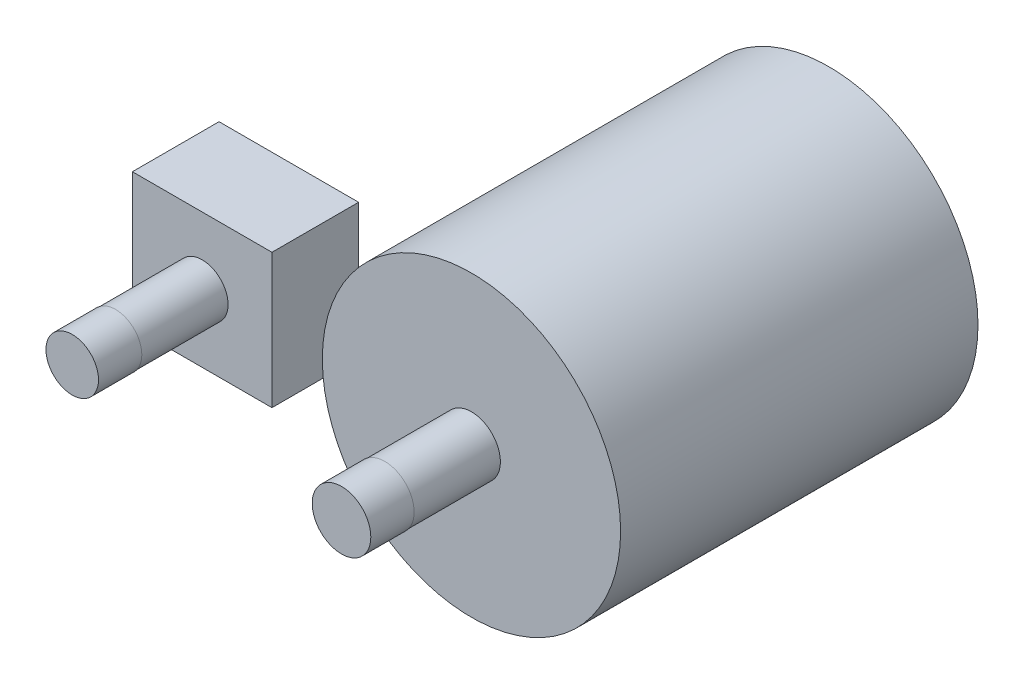
ISO-10303-21;
HEADER;
FILE_DESCRIPTION(('STEP AP214'),'2;1');
FILE_NAME('part.step','',(''),(''),'','','');
FILE_SCHEMA(('AUTOMOTIVE_DESIGN { 1 0 10303 214 1 1 1 1 }'));
ENDSEC;
DATA;
#1=APPLICATION_CONTEXT('core data for automotive mechanical design processes');
#2=APPLICATION_PROTOCOL_DEFINITION('international standard','automotive_design',2000,#1);
#3=PRODUCT_CONTEXT('',#1,'mechanical');
#4=PRODUCT('Part','Part','',(#3));
#5=PRODUCT_RELATED_PRODUCT_CATEGORY('part','',(#4));
#6=PRODUCT_DEFINITION_FORMATION('','',#4);
#7=PRODUCT_DEFINITION_CONTEXT('part definition',#1,'design');
#8=PRODUCT_DEFINITION('design','',#6,#7);
#9=PRODUCT_DEFINITION_SHAPE('','',#8);
#10=(LENGTH_UNIT() NAMED_UNIT(*) SI_UNIT(.MILLI.,.METRE.));
#11=(NAMED_UNIT(*) PLANE_ANGLE_UNIT() SI_UNIT($,.RADIAN.));
#12=(NAMED_UNIT(*) SI_UNIT($,.STERADIAN.) SOLID_ANGLE_UNIT());
#13=UNCERTAINTY_MEASURE_WITH_UNIT(LENGTH_MEASURE(1.E-05),#10,'distance_accuracy_value','');
#14=(GEOMETRIC_REPRESENTATION_CONTEXT(3) GLOBAL_UNCERTAINTY_ASSIGNED_CONTEXT((#13)) GLOBAL_UNIT_ASSIGNED_CONTEXT((#10,
#11,#12)) REPRESENTATION_CONTEXT('',''));
#15=CARTESIAN_POINT('',(0.,0.,0.));
#16=DIRECTION('',(0.,0.,1.));
#17=DIRECTION('',(1.,0.,0.));
#18=AXIS2_PLACEMENT_3D('',#15,#16,#17);
#19=CARTESIAN_POINT('',(-24.8647244854965,0.,41.));
#20=DIRECTION('',(0.,0.,-1.));
#21=DIRECTION('',(-1.,0.,0.));
#22=AXIS2_PLACEMENT_3D('',#19,#20,#21);
#23=CYLINDRICAL_SURFACE('',#22,2.39175593570654);
#24=CARTESIAN_POINT('',(-24.8647244854965,0.,41.));
#25=DIRECTION('',(0.,0.,1.));
#26=DIRECTION('',(1.,0.,0.));
#27=AXIS2_PLACEMENT_3D('',#24,#25,#26);
#28=CIRCLE('',#27,2.39175593570654);
#29=CARTESIAN_POINT('',(-22.4729685497899,0.,41.));
#30=VERTEX_POINT('',#29);
#31=EDGE_CURVE('E12',#30,#30,#28,.T.);
#32=ORIENTED_EDGE('',*,*,#31,.F.);
#33=EDGE_LOOP('',(#32));
#34=FACE_BOUND('',#33,.T.);
#35=CARTESIAN_POINT('',(-24.8647244854965,0.,33.));
#36=DIRECTION('',(0.,0.,1.));
#37=DIRECTION('',(1.,0.,0.));
#38=AXIS2_PLACEMENT_3D('',#35,#36,#37);
#39=CIRCLE('',#38,2.39175593570654);
#40=CARTESIAN_POINT('',(-22.4729685497899,0.,33.));
#41=VERTEX_POINT('',#40);
#42=EDGE_CURVE('E46',#41,#41,#39,.T.);
#43=ORIENTED_EDGE('',*,*,#42,.T.);
#44=EDGE_LOOP('',(#43));
#45=FACE_BOUND('',#44,.T.);
#46=ADVANCED_FACE('F43',(#34,#45),#23,.T.);
#47=CARTESIAN_POINT('',(-31.3070832551148,-6.21381259878717,25.));
#48=DIRECTION('',(1.,0.,0.));
#49=DIRECTION('',(0.,0.,-1.));
#50=AXIS2_PLACEMENT_3D('',#47,#48,#49);
#51=PLANE('',#50);
#52=DIRECTION('',(0.,1.,0.));
#53=VECTOR('',#52,1.);
#54=CARTESIAN_POINT('',(-31.3070832551148,-6.21381259878717,33.));
#55=LINE('',#54,#53);
#56=CARTESIAN_POINT('',(-31.3070832551148,-6.21381259878717,33.));
#57=VERTEX_POINT('',#56);
#58=CARTESIAN_POINT('',(-31.3070832551148,6.21381259878717,33.));
#59=VERTEX_POINT('',#58);
#60=EDGE_CURVE('E110',#57,#59,#55,.T.);
#61=ORIENTED_EDGE('',*,*,#60,.T.);
#62=DIRECTION('',(0.,0.,1.));
#63=VECTOR('',#62,1.);
#64=CARTESIAN_POINT('',(-31.3070832551148,6.21381259878717,25.));
#65=LINE('',#64,#63);
#66=CARTESIAN_POINT('',(-31.3070832551148,6.21381259878717,25.));
#67=VERTEX_POINT('',#66);
#68=EDGE_CURVE('E101',#67,#59,#65,.T.);
#69=ORIENTED_EDGE('',*,*,#68,.F.);
#70=DIRECTION('',(0.,1.,0.));
#71=VECTOR('',#70,1.);
#72=CARTESIAN_POINT('',(-31.3070832551148,-6.21381259878717,25.));
#73=LINE('',#72,#71);
#74=CARTESIAN_POINT('',(-31.3070832551148,-6.21381259878717,25.));
#75=VERTEX_POINT('',#74);
#76=EDGE_CURVE('E95',#75,#67,#73,.T.);
#77=ORIENTED_EDGE('',*,*,#76,.F.);
#78=DIRECTION('',(0.,0.,1.));
#79=VECTOR('',#78,1.);
#80=CARTESIAN_POINT('',(-31.3070832551148,-6.21381259878717,25.));
#81=LINE('',#80,#79);
#82=EDGE_CURVE('E106',#75,#57,#81,.T.);
#83=ORIENTED_EDGE('',*,*,#82,.T.);
#84=EDGE_LOOP('',(#61,#69,#77,#83));
#85=FACE_BOUND('',#84,.T.);
#86=ADVANCED_FACE('F130',(#85),#51,.F.);
#87=CARTESIAN_POINT('',(-18.4223657158782,6.21381259878717,25.));
#88=DIRECTION('',(0.,-1.,0.));
#89=DIRECTION('',(0.,0.,-1.));
#90=AXIS2_PLACEMENT_3D('',#87,#88,#89);
#91=PLANE('',#90);
#92=DIRECTION('',(1.,0.,0.));
#93=VECTOR('',#92,1.);
#94=CARTESIAN_POINT('',(-18.4223657158782,6.21381259878717,33.));
#95=LINE('',#94,#93);
#96=CARTESIAN_POINT('',(-18.4223657158782,6.21381259878717,33.));
#97=VERTEX_POINT('',#96);
#98=EDGE_CURVE('E100',#59,#97,#95,.T.);
#99=ORIENTED_EDGE('',*,*,#98,.T.);
#100=DIRECTION('',(0.,0.,1.));
#101=VECTOR('',#100,1.);
#102=CARTESIAN_POINT('',(-18.4223657158782,6.21381259878717,25.));
#103=LINE('',#102,#101);
#104=CARTESIAN_POINT('',(-18.4223657158782,6.21381259878717,25.));
#105=VERTEX_POINT('',#104);
#106=EDGE_CURVE('E98',#105,#97,#103,.T.);
#107=ORIENTED_EDGE('',*,*,#106,.F.);
#108=DIRECTION('',(1.,0.,0.));
#109=VECTOR('',#108,1.);
#110=CARTESIAN_POINT('',(-18.4223657158782,6.21381259878717,25.));
#111=LINE('',#110,#109);
#112=EDGE_CURVE('E90',#67,#105,#111,.T.);
#113=ORIENTED_EDGE('',*,*,#112,.F.);
#114=ORIENTED_EDGE('',*,*,#68,.T.);
#115=EDGE_LOOP('',(#99,#107,#113,#114));
#116=FACE_BOUND('',#115,.T.);
#117=ADVANCED_FACE('F99',(#116),#91,.F.);
#118=CARTESIAN_POINT('',(-18.4223657158782,-6.21381259878717,25.));
#119=DIRECTION('',(-1.,0.,0.));
#120=DIRECTION('',(0.,0.,1.));
#121=AXIS2_PLACEMENT_3D('',#118,#119,#120);
#122=PLANE('',#121);
#123=DIRECTION('',(0.,-1.,0.));
#124=VECTOR('',#123,1.);
#125=CARTESIAN_POINT('',(-18.4223657158782,-6.21381259878717,33.));
#126=LINE('',#125,#124);
#127=CARTESIAN_POINT('',(-18.4223657158782,-6.21381259878717,33.));
#128=VERTEX_POINT('',#127);
#129=EDGE_CURVE('E76',#97,#128,#126,.T.);
#130=ORIENTED_EDGE('',*,*,#129,.T.);
#131=DIRECTION('',(0.,0.,1.));
#132=VECTOR('',#131,1.);
#133=CARTESIAN_POINT('',(-18.4223657158782,-6.21381259878717,25.));
#134=LINE('',#133,#132);
#135=CARTESIAN_POINT('',(-18.4223657158782,-6.21381259878717,25.));
#136=VERTEX_POINT('',#135);
#137=EDGE_CURVE('E102',#136,#128,#134,.T.);
#138=ORIENTED_EDGE('',*,*,#137,.F.);
#139=DIRECTION('',(0.,-1.,0.));
#140=VECTOR('',#139,1.);
#141=CARTESIAN_POINT('',(-18.4223657158782,-6.21381259878717,25.));
#142=LINE('',#141,#140);
#143=EDGE_CURVE('E93',#105,#136,#142,.T.);
#144=ORIENTED_EDGE('',*,*,#143,.F.);
#145=ORIENTED_EDGE('',*,*,#106,.T.);
#146=EDGE_LOOP('',(#130,#138,#144,#145));
#147=FACE_BOUND('',#146,.T.);
#148=ADVANCED_FACE('F104',(#147),#122,.F.);
#149=CARTESIAN_POINT('',(-18.4223657158782,-6.21381259878717,25.));
#150=DIRECTION('',(0.,1.,0.));
#151=DIRECTION('',(0.,0.,1.));
#152=AXIS2_PLACEMENT_3D('',#149,#150,#151);
#153=PLANE('',#152);
#154=DIRECTION('',(-1.,0.,0.));
#155=VECTOR('',#154,1.);
#156=CARTESIAN_POINT('',(-18.4223657158782,-6.21381259878717,33.));
#157=LINE('',#156,#155);
#158=EDGE_CURVE('E82',#128,#57,#157,.T.);
#159=ORIENTED_EDGE('',*,*,#158,.T.);
#160=ORIENTED_EDGE('',*,*,#82,.F.);
#161=DIRECTION('',(-1.,0.,0.));
#162=VECTOR('',#161,1.);
#163=CARTESIAN_POINT('',(-18.4223657158782,-6.21381259878717,25.));
#164=LINE('',#163,#162);
#165=EDGE_CURVE('E59',#136,#75,#164,.T.);
#166=ORIENTED_EDGE('',*,*,#165,.F.);
#167=ORIENTED_EDGE('',*,*,#137,.T.);
#168=EDGE_LOOP('',(#159,#160,#166,#167));
#169=FACE_BOUND('',#168,.T.);
#170=ADVANCED_FACE('F131',(#169),#153,.F.);
#171=CARTESIAN_POINT('',(0.,0.,25.));
#172=DIRECTION('',(0.,0.,1.));
#173=DIRECTION('',(1.,0.,0.));
#174=AXIS2_PLACEMENT_3D('',#171,#172,#173);
#175=PLANE('',#174);
#176=ORIENTED_EDGE('',*,*,#76,.T.);
#177=ORIENTED_EDGE('',*,*,#112,.T.);
#178=ORIENTED_EDGE('',*,*,#143,.T.);
#179=ORIENTED_EDGE('',*,*,#165,.T.);
#180=EDGE_LOOP('',(#176,#177,#178,#179));
#181=FACE_BOUND('',#180,.T.);
#182=ADVANCED_FACE('F91',(#181),#175,.F.);
#183=CARTESIAN_POINT('',(0.,0.,33.));
#184=DIRECTION('',(0.,0.,1.));
#185=DIRECTION('',(1.,0.,0.));
#186=AXIS2_PLACEMENT_3D('',#183,#184,#185);
#187=PLANE('',#186);
#188=ORIENTED_EDGE('',*,*,#42,.F.);
#189=EDGE_LOOP('',(#188));
#190=FACE_BOUND('',#189,.T.);
#191=ORIENTED_EDGE('',*,*,#60,.F.);
#192=ORIENTED_EDGE('',*,*,#158,.F.);
#193=ORIENTED_EDGE('',*,*,#129,.F.);
#194=ORIENTED_EDGE('',*,*,#98,.F.);
#195=EDGE_LOOP('',(#191,#192,#193,#194));
#196=FACE_BOUND('',#195,.T.);
#197=ADVANCED_FACE('F123',(#190,#196),#187,.T.);
#198=CARTESIAN_POINT('',(-24.8647244854965,0.,45.));
#199=DIRECTION('',(0.,0.,-1.));
#200=DIRECTION('',(-1.,0.,0.));
#201=AXIS2_PLACEMENT_3D('',#198,#199,#200);
#202=CYLINDRICAL_SURFACE('',#201,2.42595453804968);
#203=CARTESIAN_POINT('',(-24.8647244854965,0.,45.));
#204=DIRECTION('',(0.,0.,1.));
#205=DIRECTION('',(1.,0.,0.));
#206=AXIS2_PLACEMENT_3D('',#203,#204,#205);
#207=CIRCLE('',#206,2.42595453804968);
#208=CARTESIAN_POINT('',(-22.4387699474468,0.,45.));
#209=VERTEX_POINT('',#208);
#210=EDGE_CURVE('E113',#209,#209,#207,.T.);
#211=ORIENTED_EDGE('',*,*,#210,.F.);
#212=EDGE_LOOP('',(#211));
#213=FACE_BOUND('',#212,.T.);
#214=CARTESIAN_POINT('',(-24.8647244854965,0.,41.));
#215=DIRECTION('',(0.,0.,1.));
#216=DIRECTION('',(1.,0.,0.));
#217=AXIS2_PLACEMENT_3D('',#214,#215,#216);
#218=CIRCLE('',#217,2.42595453804968);
#219=CARTESIAN_POINT('',(-22.4387699474468,0.,41.));
#220=VERTEX_POINT('',#219);
#221=EDGE_CURVE('E154',#220,#220,#218,.T.);
#222=ORIENTED_EDGE('',*,*,#221,.T.);
#223=EDGE_LOOP('',(#222));
#224=FACE_BOUND('',#223,.T.);
#225=ADVANCED_FACE('F126',(#213,#224),#202,.T.);
#226=CARTESIAN_POINT('',(-24.8647244854965,0.,45.));
#227=DIRECTION('',(0.,0.,1.));
#228=DIRECTION('',(1.,0.,0.));
#229=AXIS2_PLACEMENT_3D('',#226,#227,#228);
#230=PLANE('',#229);
#231=ORIENTED_EDGE('',*,*,#210,.T.);
#232=EDGE_LOOP('',(#231));
#233=FACE_BOUND('',#232,.T.);
#234=ADVANCED_FACE('F150',(#233),#230,.T.);
#235=CARTESIAN_POINT('',(-24.8647244854965,0.,41.));
#236=DIRECTION('',(0.,0.,1.));
#237=DIRECTION('',(1.,0.,0.));
#238=AXIS2_PLACEMENT_3D('',#235,#236,#237);
#239=PLANE('',#238);
#240=ORIENTED_EDGE('',*,*,#31,.T.);
#241=EDGE_LOOP('',(#240));
#242=FACE_BOUND('',#241,.T.);
#243=ORIENTED_EDGE('',*,*,#221,.F.);
#244=EDGE_LOOP('',(#243));
#245=FACE_BOUND('',#244,.T.);
#246=ADVANCED_FACE('F147',(#242,#245),#239,.F.);
#247=CLOSED_SHELL('',(#46,#86,#117,#148,#170,#182,#197,#225,#234,#246));
#248=MANIFOLD_SOLID_BREP('B2',#247);
#249=CARTESIAN_POINT('',(0.,0.,33.));
#250=DIRECTION('',(0.,0.,-1.));
#251=DIRECTION('',(-1.,0.,0.));
#252=AXIS2_PLACEMENT_3D('',#249,#250,#251);
#253=CYLINDRICAL_SURFACE('',#252,13.7713116662806);
#254=CARTESIAN_POINT('',(0.,0.,33.));
#255=DIRECTION('',(0.,0.,1.));
#256=DIRECTION('',(1.,0.,0.));
#257=AXIS2_PLACEMENT_3D('',#254,#255,#256);
#258=CIRCLE('',#257,13.7713116662806);
#259=CARTESIAN_POINT('',(13.7713116662806,0.,33.));
#260=VERTEX_POINT('',#259);
#261=EDGE_CURVE('E234',#260,#260,#258,.T.);
#262=ORIENTED_EDGE('',*,*,#261,.F.);
#263=EDGE_LOOP('',(#262));
#264=FACE_BOUND('',#263,.T.);
#265=CARTESIAN_POINT('',(0.,0.,0.));
#266=DIRECTION('',(0.,0.,1.));
#267=DIRECTION('',(1.,0.,0.));
#268=AXIS2_PLACEMENT_3D('',#265,#266,#267);
#269=CIRCLE('',#268,13.7713116662806);
#270=CARTESIAN_POINT('',(13.7713116662806,0.,0.));
#271=VERTEX_POINT('',#270);
#272=EDGE_CURVE('E230',#271,#271,#269,.T.);
#273=ORIENTED_EDGE('',*,*,#272,.T.);
#274=EDGE_LOOP('',(#273));
#275=FACE_BOUND('',#274,.T.);
#276=ADVANCED_FACE('F227',(#264,#275),#253,.T.);
#277=CARTESIAN_POINT('',(0.,0.,33.));
#278=DIRECTION('',(0.,0.,1.));
#279=DIRECTION('',(1.,0.,0.));
#280=AXIS2_PLACEMENT_3D('',#277,#278,#279);
#281=PLANE('',#280);
#282=CARTESIAN_POINT('',(0.,0.,33.));
#283=DIRECTION('',(0.,0.,1.));
#284=DIRECTION('',(1.,0.,0.));
#285=AXIS2_PLACEMENT_3D('',#282,#283,#284);
#286=CIRCLE('',#285,2.67046061904313);
#287=CARTESIAN_POINT('',(2.67046061904313,0.,33.));
#288=VERTEX_POINT('',#287);
#289=EDGE_CURVE('E42',#288,#288,#286,.T.);
#290=ORIENTED_EDGE('',*,*,#289,.F.);
#291=EDGE_LOOP('',(#290));
#292=FACE_BOUND('',#291,.T.);
#293=ORIENTED_EDGE('',*,*,#261,.T.);
#294=EDGE_LOOP('',(#293));
#295=FACE_BOUND('',#294,.T.);
#296=ADVANCED_FACE('F268',(#292,#295),#281,.T.);
#297=CARTESIAN_POINT('',(0.,0.,0.));
#298=DIRECTION('',(0.,0.,1.));
#299=DIRECTION('',(1.,0.,0.));
#300=AXIS2_PLACEMENT_3D('',#297,#298,#299);
#301=PLANE('',#300);
#302=ORIENTED_EDGE('',*,*,#272,.F.);
#303=EDGE_LOOP('',(#302));
#304=FACE_BOUND('',#303,.T.);
#305=ADVANCED_FACE('F273',(#304),#301,.F.);
#306=CARTESIAN_POINT('',(0.,0.,41.));
#307=DIRECTION('',(0.,0.,-1.));
#308=DIRECTION('',(-1.,0.,0.));
#309=AXIS2_PLACEMENT_3D('',#306,#307,#308);
#310=CYLINDRICAL_SURFACE('',#309,2.67046061904313);
#311=CARTESIAN_POINT('',(0.,0.,41.));
#312=DIRECTION('',(0.,0.,1.));
#313=DIRECTION('',(1.,0.,0.));
#314=AXIS2_PLACEMENT_3D('',#311,#312,#313);
#315=CIRCLE('',#314,2.67046061904313);
#316=CARTESIAN_POINT('',(2.67046061904313,0.,41.));
#317=VERTEX_POINT('',#316);
#318=EDGE_CURVE('E240',#317,#317,#315,.T.);
#319=ORIENTED_EDGE('',*,*,#318,.F.);
#320=EDGE_LOOP('',(#319));
#321=FACE_BOUND('',#320,.T.);
#322=ORIENTED_EDGE('',*,*,#289,.T.);
#323=EDGE_LOOP('',(#322));
#324=FACE_BOUND('',#323,.T.);
#325=ADVANCED_FACE('F255',(#321,#324),#310,.T.);
#326=CARTESIAN_POINT('',(0.,0.,45.));
#327=DIRECTION('',(0.,0.,-1.));
#328=DIRECTION('',(-1.,0.,0.));
#329=AXIS2_PLACEMENT_3D('',#326,#327,#328);
#330=CYLINDRICAL_SURFACE('',#329,2.7046062);
#331=CARTESIAN_POINT('',(0.,0.,45.));
#332=DIRECTION('',(0.,0.,1.));
#333=DIRECTION('',(1.,0.,0.));
#334=AXIS2_PLACEMENT_3D('',#331,#332,#333);
#335=CIRCLE('',#334,2.7046062);
#336=CARTESIAN_POINT('',(2.7046062,0.,45.));
#337=VERTEX_POINT('',#336);
#338=EDGE_CURVE('E243',#337,#337,#335,.T.);
#339=ORIENTED_EDGE('',*,*,#338,.F.);
#340=EDGE_LOOP('',(#339));
#341=FACE_BOUND('',#340,.T.);
#342=CARTESIAN_POINT('',(0.,0.,41.));
#343=DIRECTION('',(0.,0.,1.));
#344=DIRECTION('',(1.,0.,0.));
#345=AXIS2_PLACEMENT_3D('',#342,#343,#344);
#346=CIRCLE('',#345,2.7046062);
#347=CARTESIAN_POINT('',(2.7046062,0.,41.));
#348=VERTEX_POINT('',#347);
#349=EDGE_CURVE('E244',#348,#348,#346,.T.);
#350=ORIENTED_EDGE('',*,*,#349,.T.);
#351=EDGE_LOOP('',(#350));
#352=FACE_BOUND('',#351,.T.);
#353=ADVANCED_FACE('F252',(#341,#352),#330,.T.);
#354=CARTESIAN_POINT('',(0.,0.,45.));
#355=DIRECTION('',(0.,0.,1.));
#356=DIRECTION('',(1.,0.,0.));
#357=AXIS2_PLACEMENT_3D('',#354,#355,#356);
#358=PLANE('',#357);
#359=ORIENTED_EDGE('',*,*,#338,.T.);
#360=EDGE_LOOP('',(#359));
#361=FACE_BOUND('',#360,.T.);
#362=ADVANCED_FACE('F250',(#361),#358,.T.);
#363=CARTESIAN_POINT('',(0.,0.,41.));
#364=DIRECTION('',(0.,0.,1.));
#365=DIRECTION('',(1.,0.,0.));
#366=AXIS2_PLACEMENT_3D('',#363,#364,#365);
#367=PLANE('',#366);
#368=ORIENTED_EDGE('',*,*,#318,.T.);
#369=EDGE_LOOP('',(#368));
#370=FACE_BOUND('',#369,.T.);
#371=ORIENTED_EDGE('',*,*,#349,.F.);
#372=EDGE_LOOP('',(#371));
#373=FACE_BOUND('',#372,.T.);
#374=ADVANCED_FACE('F259',(#370,#373),#367,.F.);
#375=CLOSED_SHELL('',(#276,#296,#305,#325,#353,#362,#374));
#376=MANIFOLD_SOLID_BREP('B6',#375);
#377=ADVANCED_BREP_SHAPE_REPRESENTATION('',(#18,#248,#376),#14);
#378=SHAPE_DEFINITION_REPRESENTATION(#9,#377);
ENDSEC;
END-ISO-10303-21;
